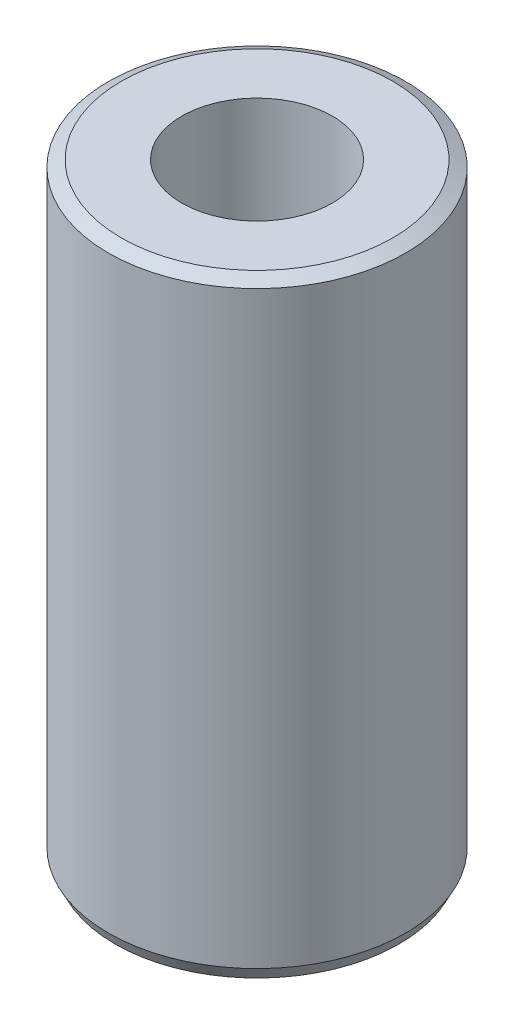
ISO-10303-21;
HEADER;
FILE_DESCRIPTION(('STEP AP214'),'2;1');
FILE_NAME('part.step','',(''),(''),'','','');
FILE_SCHEMA(('AUTOMOTIVE_DESIGN { 1 0 10303 214 1 1 1 1 }'));
ENDSEC;
DATA;
#1=APPLICATION_CONTEXT('core data for automotive mechanical design processes');
#2=APPLICATION_PROTOCOL_DEFINITION('international standard','automotive_design',2000,#1);
#3=PRODUCT_CONTEXT('',#1,'mechanical');
#4=PRODUCT('Part','Part','',(#3));
#5=PRODUCT_RELATED_PRODUCT_CATEGORY('part','',(#4));
#6=PRODUCT_DEFINITION_FORMATION('','',#4);
#7=PRODUCT_DEFINITION_CONTEXT('part definition',#1,'design');
#8=PRODUCT_DEFINITION('design','',#6,#7);
#9=PRODUCT_DEFINITION_SHAPE('','',#8);
#10=(LENGTH_UNIT() NAMED_UNIT(*) SI_UNIT(.MILLI.,.METRE.));
#11=(NAMED_UNIT(*) PLANE_ANGLE_UNIT() SI_UNIT($,.RADIAN.));
#12=(NAMED_UNIT(*) SI_UNIT($,.STERADIAN.) SOLID_ANGLE_UNIT());
#13=UNCERTAINTY_MEASURE_WITH_UNIT(LENGTH_MEASURE(1.E-05),#10,'distance_accuracy_value','');
#14=(GEOMETRIC_REPRESENTATION_CONTEXT(3) GLOBAL_UNCERTAINTY_ASSIGNED_CONTEXT((#13)) GLOBAL_UNIT_ASSIGNED_CONTEXT((#10,
#11,#12)) REPRESENTATION_CONTEXT('',''));
#15=CARTESIAN_POINT('',(0.,0.,0.));
#16=DIRECTION('',(0.,0.,1.));
#17=DIRECTION('',(1.,0.,0.));
#18=AXIS2_PLACEMENT_3D('',#15,#16,#17);
#19=CARTESIAN_POINT('',(0.,204.716866867194,0.));
#20=DIRECTION('',(0.,-1.,0.));
#21=DIRECTION('',(0.,0.,-1.));
#22=AXIS2_PLACEMENT_3D('',#19,#20,#21);
#23=CYLINDRICAL_SURFACE('',#22,50.);
#24=CARTESIAN_POINT('',(0.,202.476665811698,0.));
#25=DIRECTION('',(0.,1.,0.));
#26=DIRECTION('',(0.,0.,1.));
#27=AXIS2_PLACEMENT_3D('',#24,#25,#26);
#28=CIRCLE('',#27,50.);
#29=CARTESIAN_POINT('',(0.,202.476665811698,50.));
#30=VERTEX_POINT('',#29);
#31=EDGE_CURVE('E50',#30,#30,#28,.F.);
#32=ORIENTED_EDGE('',*,*,#31,.T.);
#33=EDGE_LOOP('',(#32));
#34=FACE_BOUND('',#33,.T.);
#35=CARTESIAN_POINT('',(0.,4.33518442576183,0.));
#36=DIRECTION('',(0.,1.,0.));
#37=DIRECTION('',(0.,0.,1.));
#38=AXIS2_PLACEMENT_3D('',#35,#36,#37);
#39=CIRCLE('',#38,50.);
#40=CARTESIAN_POINT('',(0.,4.33518442576183,50.));
#41=VERTEX_POINT('',#40);
#42=EDGE_CURVE('E51',#41,#41,#39,.T.);
#43=ORIENTED_EDGE('',*,*,#42,.T.);
#44=EDGE_LOOP('',(#43));
#45=FACE_BOUND('',#44,.T.);
#46=ADVANCED_FACE('F39',(#34,#45),#23,.T.);
#47=CARTESIAN_POINT('',(0.,204.716866867194,0.));
#48=DIRECTION('',(0.,1.,0.));
#49=DIRECTION('',(0.,0.,1.));
#50=AXIS2_PLACEMENT_3D('',#47,#48,#49);
#51=PLANE('',#50);
#52=CARTESIAN_POINT('',(0.,204.716866867194,0.));
#53=DIRECTION('',(0.,1.,0.));
#54=DIRECTION('',(0.,0.,1.));
#55=AXIS2_PLACEMENT_3D('',#52,#53,#54);
#56=CIRCLE('',#55,45.6648155742383);
#57=CARTESIAN_POINT('',(0.,204.716866867194,45.6648155742383));
#58=VERTEX_POINT('',#57);
#59=EDGE_CURVE('E54',#58,#58,#56,.T.);
#60=ORIENTED_EDGE('',*,*,#59,.T.);
#61=EDGE_LOOP('',(#60));
#62=FACE_BOUND('',#61,.T.);
#63=CARTESIAN_POINT('',(0.,204.716866867194,0.));
#64=DIRECTION('',(0.,1.,0.));
#65=DIRECTION('',(0.,0.,1.));
#66=AXIS2_PLACEMENT_3D('',#63,#64,#65);
#67=CIRCLE('',#66,25.3549736331181);
#68=CARTESIAN_POINT('',(0.,204.716866867194,25.3549736331181));
#69=VERTEX_POINT('',#68);
#70=EDGE_CURVE('E58',#69,#69,#67,.T.);
#71=ORIENTED_EDGE('',*,*,#70,.F.);
#72=EDGE_LOOP('',(#71));
#73=FACE_BOUND('',#72,.T.);
#74=ADVANCED_FACE('F69',(#62,#73),#51,.T.);
#75=CARTESIAN_POINT('',(0.,0.,0.));
#76=DIRECTION('',(0.,1.,0.));
#77=DIRECTION('',(0.,0.,1.));
#78=AXIS2_PLACEMENT_3D('',#75,#76,#77);
#79=PLANE('',#78);
#80=CARTESIAN_POINT('',(0.,0.,0.));
#81=DIRECTION('',(0.,1.,0.));
#82=DIRECTION('',(0.,0.,1.));
#83=AXIS2_PLACEMENT_3D('',#80,#81,#82);
#84=CIRCLE('',#83,47.7597989445033);
#85=CARTESIAN_POINT('',(0.,0.,47.7597989445033));
#86=VERTEX_POINT('',#85);
#87=EDGE_CURVE('E10',#86,#86,#84,.F.);
#88=ORIENTED_EDGE('',*,*,#87,.T.);
#89=EDGE_LOOP('',(#88));
#90=FACE_BOUND('',#89,.T.);
#91=CARTESIAN_POINT('',(0.,0.,0.));
#92=DIRECTION('',(0.,1.,0.));
#93=DIRECTION('',(0.,0.,1.));
#94=AXIS2_PLACEMENT_3D('',#91,#92,#93);
#95=CIRCLE('',#94,25.3549736331181);
#96=CARTESIAN_POINT('',(0.,0.,25.3549736331181));
#97=VERTEX_POINT('',#96);
#98=EDGE_CURVE('E63',#97,#97,#95,.T.);
#99=ORIENTED_EDGE('',*,*,#98,.T.);
#100=EDGE_LOOP('',(#99));
#101=FACE_BOUND('',#100,.T.);
#102=ADVANCED_FACE('F75',(#90,#101),#79,.F.);
#103=CARTESIAN_POINT('',(0.,204.716866867194,0.));
#104=DIRECTION('',(0.,-1.,0.));
#105=DIRECTION('',(0.,0.,-1.));
#106=AXIS2_PLACEMENT_3D('',#103,#104,#105);
#107=CYLINDRICAL_SURFACE('',#106,25.3549736331181);
#108=ORIENTED_EDGE('',*,*,#70,.T.);
#109=EDGE_LOOP('',(#108));
#110=FACE_BOUND('',#109,.T.);
#111=ORIENTED_EDGE('',*,*,#98,.F.);
#112=EDGE_LOOP('',(#111));
#113=FACE_BOUND('',#112,.T.);
#114=ADVANCED_FACE('F70',(#110,#113),#107,.F.);
#115=CARTESIAN_POINT('',(0.,204.716866867194,0.));
#116=DIRECTION('',(0.,-1.,0.));
#117=DIRECTION('',(0.,0.,-1.));
#118=AXIS2_PLACEMENT_3D('',#115,#116,#117);
#119=CONICAL_SURFACE('',#118,45.6648155742383,1.0938396869903);
#120=ORIENTED_EDGE('',*,*,#31,.F.);
#121=EDGE_LOOP('',(#120));
#122=FACE_BOUND('',#121,.T.);
#123=ORIENTED_EDGE('',*,*,#59,.F.);
#124=EDGE_LOOP('',(#123));
#125=FACE_BOUND('',#124,.T.);
#126=ADVANCED_FACE('F81',(#122,#125),#119,.T.);
#127=CARTESIAN_POINT('',(0.,4.33518442576183,0.));
#128=DIRECTION('',(0.,1.,0.));
#129=DIRECTION('',(0.,0.,1.));
#130=AXIS2_PLACEMENT_3D('',#127,#128,#129);
#131=CONICAL_SURFACE('',#130,50.,0.476956639804599);
#132=ORIENTED_EDGE('',*,*,#87,.F.);
#133=EDGE_LOOP('',(#132));
#134=FACE_BOUND('',#133,.T.);
#135=ORIENTED_EDGE('',*,*,#42,.F.);
#136=EDGE_LOOP('',(#135));
#137=FACE_BOUND('',#136,.T.);
#138=ADVANCED_FACE('F45',(#134,#137),#131,.T.);
#139=CLOSED_SHELL('',(#46,#74,#102,#114,#126,#138));
#140=MANIFOLD_SOLID_BREP('B2',#139);
#141=ADVANCED_BREP_SHAPE_REPRESENTATION('',(#18,#140),#14);
#142=SHAPE_DEFINITION_REPRESENTATION(#9,#141);
ENDSEC;
END-ISO-10303-21;
